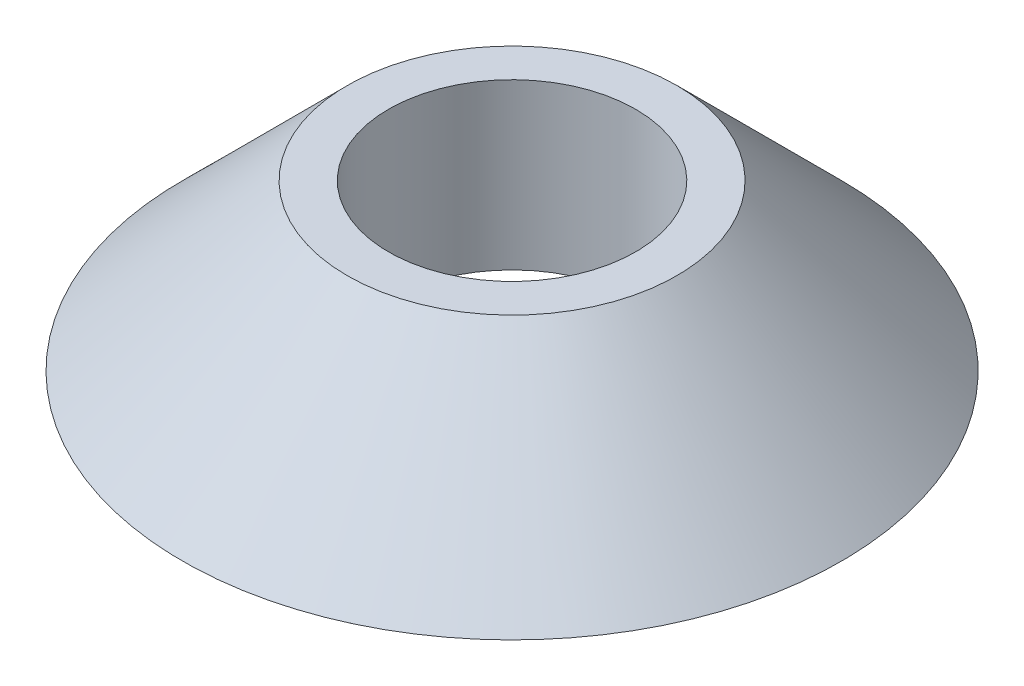
ISO-10303-21;
HEADER;
FILE_DESCRIPTION(('STEP AP214'),'2;1');
FILE_NAME('part.step','',(''),(''),'','','');
FILE_SCHEMA(('AUTOMOTIVE_DESIGN { 1 0 10303 214 1 1 1 1 }'));
ENDSEC;
DATA;
#1=APPLICATION_CONTEXT('core data for automotive mechanical design processes');
#2=APPLICATION_PROTOCOL_DEFINITION('international standard','automotive_design',2000,#1);
#3=PRODUCT_CONTEXT('',#1,'mechanical');
#4=PRODUCT('Part','Part','',(#3));
#5=PRODUCT_RELATED_PRODUCT_CATEGORY('part','',(#4));
#6=PRODUCT_DEFINITION_FORMATION('','',#4);
#7=PRODUCT_DEFINITION_CONTEXT('part definition',#1,'design');
#8=PRODUCT_DEFINITION('design','',#6,#7);
#9=PRODUCT_DEFINITION_SHAPE('','',#8);
#10=(LENGTH_UNIT() NAMED_UNIT(*) SI_UNIT(.MILLI.,.METRE.));
#11=(NAMED_UNIT(*) PLANE_ANGLE_UNIT() SI_UNIT($,.RADIAN.));
#12=(NAMED_UNIT(*) SI_UNIT($,.STERADIAN.) SOLID_ANGLE_UNIT());
#13=UNCERTAINTY_MEASURE_WITH_UNIT(LENGTH_MEASURE(1.E-05),#10,'distance_accuracy_value','');
#14=(GEOMETRIC_REPRESENTATION_CONTEXT(3) GLOBAL_UNCERTAINTY_ASSIGNED_CONTEXT((#13)) GLOBAL_UNIT_ASSIGNED_CONTEXT((#10,
#11,#12)) REPRESENTATION_CONTEXT('',''));
#15=CARTESIAN_POINT('',(0.,0.,0.));
#16=DIRECTION('',(0.,0.,1.));
#17=DIRECTION('',(1.,0.,0.));
#18=AXIS2_PLACEMENT_3D('',#15,#16,#17);
#19=CARTESIAN_POINT('',(0.,0.,0.));
#20=DIRECTION('',(0.,-1.,0.));
#21=DIRECTION('',(0.,0.,-1.));
#22=AXIS2_PLACEMENT_3D('',#19,#20,#21);
#23=CONICAL_SURFACE('',#22,25.4000000000001,0.785398163397454);
#24=CARTESIAN_POINT('',(0.,12.6999999999999,0.));
#25=DIRECTION('',(0.,-1.,0.));
#26=DIRECTION('',(0.,0.,-1.));
#27=AXIS2_PLACEMENT_3D('',#24,#25,#26);
#28=CIRCLE('',#27,12.7);
#29=CARTESIAN_POINT('',(0.,12.6999999999999,-12.7));
#30=VERTEX_POINT('',#29);
#31=EDGE_CURVE('E10',#30,#30,#28,.T.);
#32=ORIENTED_EDGE('',*,*,#31,.T.);
#33=EDGE_LOOP('',(#32));
#34=FACE_BOUND('',#33,.T.);
#35=CARTESIAN_POINT('',(0.,0.,0.));
#36=DIRECTION('',(0.,-1.,0.));
#37=DIRECTION('',(0.,0.,-1.));
#38=AXIS2_PLACEMENT_3D('',#35,#36,#37);
#39=CIRCLE('',#38,25.4000000000001);
#40=CARTESIAN_POINT('',(0.,0.,-25.4000000000001));
#41=VERTEX_POINT('',#40);
#42=EDGE_CURVE('E44',#41,#41,#39,.T.);
#43=ORIENTED_EDGE('',*,*,#42,.F.);
#44=EDGE_LOOP('',(#43));
#45=FACE_BOUND('',#44,.T.);
#46=ADVANCED_FACE('F30',(#34,#45),#23,.T.);
#47=CARTESIAN_POINT('',(12.7,12.7,0.));
#48=DIRECTION('',(0.,1.,0.));
#49=DIRECTION('',(0.,0.,1.));
#50=AXIS2_PLACEMENT_3D('',#47,#48,#49);
#51=PLANE('',#50);
#52=CARTESIAN_POINT('',(0.,12.6999999999999,0.));
#53=DIRECTION('',(0.,-1.,0.));
#54=DIRECTION('',(0.,0.,-1.));
#55=AXIS2_PLACEMENT_3D('',#52,#53,#54);
#56=CIRCLE('',#55,9.525);
#57=CARTESIAN_POINT('',(0.,12.6999999999999,-9.525));
#58=VERTEX_POINT('',#57);
#59=EDGE_CURVE('E36',#58,#58,#56,.T.);
#60=ORIENTED_EDGE('',*,*,#59,.T.);
#61=EDGE_LOOP('',(#60));
#62=FACE_BOUND('',#61,.T.);
#63=ORIENTED_EDGE('',*,*,#31,.F.);
#64=EDGE_LOOP('',(#63));
#65=FACE_BOUND('',#64,.T.);
#66=ADVANCED_FACE('F54',(#62,#65),#51,.T.);
#67=CARTESIAN_POINT('',(0.,-1000.69375591004,0.));
#68=DIRECTION('',(0.,-1.,0.));
#69=DIRECTION('',(0.,0.,-1.));
#70=AXIS2_PLACEMENT_3D('',#67,#68,#69);
#71=CYLINDRICAL_SURFACE('',#70,9.525);
#72=CARTESIAN_POINT('',(0.,0.,0.));
#73=DIRECTION('',(0.,-1.,0.));
#74=DIRECTION('',(0.,0.,-1.));
#75=AXIS2_PLACEMENT_3D('',#72,#73,#74);
#76=CIRCLE('',#75,9.525);
#77=CARTESIAN_POINT('',(0.,0.,-9.525));
#78=VERTEX_POINT('',#77);
#79=EDGE_CURVE('E40',#78,#78,#76,.T.);
#80=ORIENTED_EDGE('',*,*,#79,.T.);
#81=EDGE_LOOP('',(#80));
#82=FACE_BOUND('',#81,.T.);
#83=ORIENTED_EDGE('',*,*,#59,.F.);
#84=EDGE_LOOP('',(#83));
#85=FACE_BOUND('',#84,.T.);
#86=ADVANCED_FACE('F58',(#82,#85),#71,.F.);
#87=CARTESIAN_POINT('',(9.525,0.,0.));
#88=DIRECTION('',(0.,-1.,0.));
#89=DIRECTION('',(0.,0.,-1.));
#90=AXIS2_PLACEMENT_3D('',#87,#88,#89);
#91=PLANE('',#90);
#92=ORIENTED_EDGE('',*,*,#42,.T.);
#93=EDGE_LOOP('',(#92));
#94=FACE_BOUND('',#93,.T.);
#95=ORIENTED_EDGE('',*,*,#79,.F.);
#96=EDGE_LOOP('',(#95));
#97=FACE_BOUND('',#96,.T.);
#98=ADVANCED_FACE('F50',(#94,#97),#91,.T.);
#99=CLOSED_SHELL('',(#46,#66,#86,#98));
#100=MANIFOLD_SOLID_BREP('B2',#99);
#101=ADVANCED_BREP_SHAPE_REPRESENTATION('',(#18,#100),#14);
#102=SHAPE_DEFINITION_REPRESENTATION(#9,#101);
ENDSEC;
END-ISO-10303-21;
